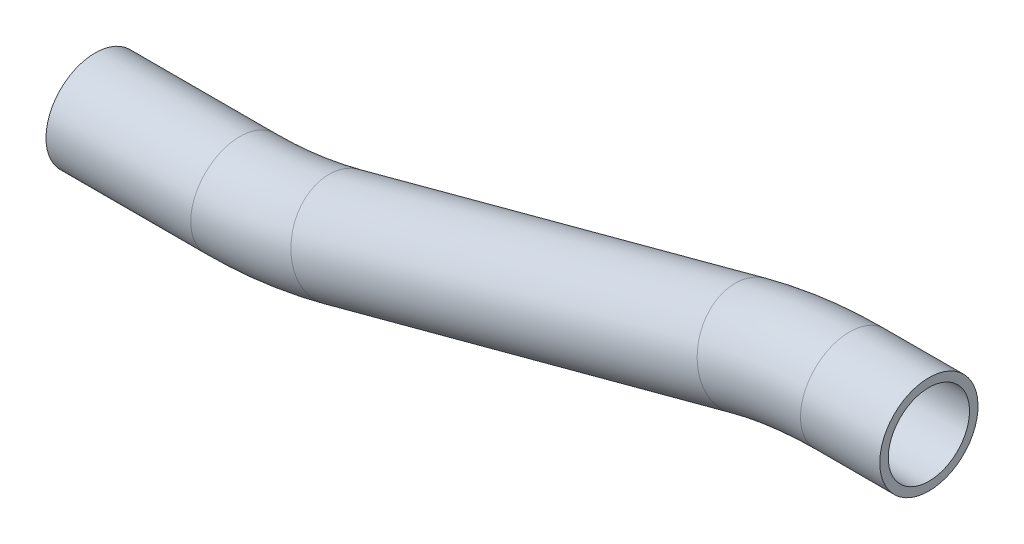
ISO-10303-21;
HEADER;
FILE_DESCRIPTION(('STEP AP214'),'2;1');
FILE_NAME('part.step','',(''),(''),'','','');
FILE_SCHEMA(('AUTOMOTIVE_DESIGN { 1 0 10303 214 1 1 1 1 }'));
ENDSEC;
DATA;
#1=APPLICATION_CONTEXT('core data for automotive mechanical design processes');
#2=APPLICATION_PROTOCOL_DEFINITION('international standard','automotive_design',2000,#1);
#3=PRODUCT_CONTEXT('',#1,'mechanical');
#4=PRODUCT('Part','Part','',(#3));
#5=PRODUCT_RELATED_PRODUCT_CATEGORY('part','',(#4));
#6=PRODUCT_DEFINITION_FORMATION('','',#4);
#7=PRODUCT_DEFINITION_CONTEXT('part definition',#1,'design');
#8=PRODUCT_DEFINITION('design','',#6,#7);
#9=PRODUCT_DEFINITION_SHAPE('','',#8);
#10=(LENGTH_UNIT() NAMED_UNIT(*) SI_UNIT(.MILLI.,.METRE.));
#11=(NAMED_UNIT(*) PLANE_ANGLE_UNIT() SI_UNIT($,.RADIAN.));
#12=(NAMED_UNIT(*) SI_UNIT($,.STERADIAN.) SOLID_ANGLE_UNIT());
#13=UNCERTAINTY_MEASURE_WITH_UNIT(LENGTH_MEASURE(1.E-05),#10,'distance_accuracy_value','');
#14=(GEOMETRIC_REPRESENTATION_CONTEXT(3) GLOBAL_UNCERTAINTY_ASSIGNED_CONTEXT((#13)) GLOBAL_UNIT_ASSIGNED_CONTEXT((#10,
#11,#12)) REPRESENTATION_CONTEXT('',''));
#15=CARTESIAN_POINT('',(0.,0.,0.));
#16=DIRECTION('',(0.,0.,1.));
#17=DIRECTION('',(1.,0.,0.));
#18=AXIS2_PLACEMENT_3D('',#15,#16,#17);
#19=CARTESIAN_POINT('',(15.3680796838403,0.,0.));
#20=DIRECTION('',(-1.,0.,0.));
#21=DIRECTION('',(0.,-1.,0.));
#22=AXIS2_PLACEMENT_3D('',#19,#20,#21);
#23=CYLINDRICAL_SURFACE('',#22,9.525);
#24=CARTESIAN_POINT('',(0.,0.,0.));
#25=DIRECTION('',(-1.,0.,0.));
#26=DIRECTION('',(0.,-1.,0.));
#27=AXIS2_PLACEMENT_3D('',#24,#25,#26);
#28=CIRCLE('',#27,9.525);
#29=CARTESIAN_POINT('',(0.,9.52499999999998,0.));
#30=VERTEX_POINT('',#29);
#31=EDGE_CURVE('E61',#30,#30,#28,.T.);
#32=ORIENTED_EDGE('',*,*,#31,.F.);
#33=EDGE_LOOP('',(#32));
#34=FACE_BOUND('',#33,.T.);
#35=CARTESIAN_POINT('',(15.3680796838403,0.,0.));
#36=DIRECTION('',(-1.,0.,0.));
#37=DIRECTION('',(0.,-1.,0.));
#38=AXIS2_PLACEMENT_3D('',#35,#36,#37);
#39=CIRCLE('',#38,9.525);
#40=CARTESIAN_POINT('',(15.3680796838403,-9.525,0.));
#41=VERTEX_POINT('',#40);
#42=EDGE_CURVE('E58',#41,#41,#39,.T.);
#43=ORIENTED_EDGE('',*,*,#42,.T.);
#44=EDGE_LOOP('',(#43));
#45=FACE_BOUND('',#44,.T.);
#46=ADVANCED_FACE('F37',(#34,#45),#23,.T.);
#47=CARTESIAN_POINT('',(0.,-76.2,0.));
#48=DIRECTION('',(0.,0.,1.));
#49=DIRECTION('',(1.,0.,0.));
#50=AXIS2_PLACEMENT_3D('',#47,#48,#49);
#51=TOROIDAL_SURFACE('',#50,76.2,9.525);
#52=CARTESIAN_POINT('',(-19.7220112368122,-2.59645203677303,0.));
#53=DIRECTION('',(-0.965925826289068,-0.258819045102522,0.));
#54=DIRECTION('',(0.258819045102522,-0.965925826289068,0.));
#55=AXIS2_PLACEMENT_3D('',#52,#53,#54);
#56=CIRCLE('',#55,9.525);
#57=CARTESIAN_POINT('',(-22.1872626414137,6.60399145863036,0.));
#58=VERTEX_POINT('',#57);
#59=EDGE_CURVE('E64',#58,#58,#56,.T.);
#60=CARTESIAN_POINT('',(0.,-76.2,0.));
#61=DIRECTION('',(0.,0.,1.));
#62=DIRECTION('',(1.,0.,0.));
#63=AXIS2_PLACEMENT_3D('',#60,#61,#62);
#64=CIRCLE('',#63,85.725);
#65=EDGE_CURVE('',#30,#58,#64,.T.);
#66=ORIENTED_EDGE('',*,*,#31,.T.);
#67=ORIENTED_EDGE('',*,*,#59,.F.);
#68=ORIENTED_EDGE('',*,*,#65,.T.);
#69=ORIENTED_EDGE('',*,*,#65,.F.);
#70=EDGE_LOOP('',(#66,#68,#67,#69));
#71=FACE_BOUND('',#70,.T.);
#72=ADVANCED_FACE('F83',(#71),#51,.T.);
#73=CARTESIAN_POINT('',(-19.7220112368122,-2.59645203677303,0.));
#74=DIRECTION('',(-0.965925826289068,-0.258819045102522,0.));
#75=DIRECTION('',(0.258819045102522,-0.965925826289068,0.));
#76=AXIS2_PLACEMENT_3D('',#73,#74,#75);
#77=CYLINDRICAL_SURFACE('',#76,9.525);
#78=CARTESIAN_POINT('',(-98.4798933464764,-23.6995629456432,0.));
#79=DIRECTION('',(-0.965925826289068,-0.258819045102522,0.));
#80=DIRECTION('',(0.258819045102522,-0.965925826289068,0.));
#81=AXIS2_PLACEMENT_3D('',#78,#79,#80);
#82=CIRCLE('',#81,9.525);
#83=CARTESIAN_POINT('',(-96.0146419418749,-32.9000064410466,0.));
#84=VERTEX_POINT('',#83);
#85=EDGE_CURVE('E66',#84,#84,#82,.T.);
#86=ORIENTED_EDGE('',*,*,#85,.F.);
#87=EDGE_LOOP('',(#86));
#88=FACE_BOUND('',#87,.T.);
#89=ORIENTED_EDGE('',*,*,#59,.T.);
#90=EDGE_LOOP('',(#89));
#91=FACE_BOUND('',#90,.T.);
#92=ADVANCED_FACE('F76',(#88,#91),#77,.T.);
#93=CARTESIAN_POINT('',(-118.201904583289,49.9039850175838,0.));
#94=DIRECTION('',(0.,0.,-1.));
#95=DIRECTION('',(-1.,0.,0.));
#96=AXIS2_PLACEMENT_3D('',#93,#94,#95);
#97=TOROIDAL_SURFACE('',#96,76.2,9.525);
#98=CARTESIAN_POINT('',(-118.201904583288,-26.2960149824163,0.));
#99=DIRECTION('',(-1.,0.,0.));
#100=DIRECTION('',(0.,-1.,0.));
#101=AXIS2_PLACEMENT_3D('',#98,#99,#100);
#102=CIRCLE('',#101,9.525);
#103=CARTESIAN_POINT('',(-118.201904583288,-35.8210149824162,0.));
#104=VERTEX_POINT('',#103);
#105=EDGE_CURVE('E41',#104,#104,#102,.T.);
#106=CARTESIAN_POINT('',(-118.201904583289,49.9039850175838,0.));
#107=DIRECTION('',(0.,0.,-1.));
#108=DIRECTION('',(-1.,0.,0.));
#109=AXIS2_PLACEMENT_3D('',#106,#107,#108);
#110=CIRCLE('',#109,85.725);
#111=EDGE_CURVE('',#84,#104,#110,.T.);
#112=ORIENTED_EDGE('',*,*,#85,.T.);
#113=ORIENTED_EDGE('',*,*,#105,.F.);
#114=ORIENTED_EDGE('',*,*,#111,.T.);
#115=ORIENTED_EDGE('',*,*,#111,.F.);
#116=EDGE_LOOP('',(#112,#114,#113,#115));
#117=FACE_BOUND('',#116,.T.);
#118=ADVANCED_FACE('F74',(#117),#97,.T.);
#119=CARTESIAN_POINT('',(-118.201904583288,-26.2960149824163,0.));
#120=DIRECTION('',(-1.,0.,0.));
#121=DIRECTION('',(0.,-1.,0.));
#122=AXIS2_PLACEMENT_3D('',#119,#120,#121);
#123=CYLINDRICAL_SURFACE('',#122,9.525);
#124=CARTESIAN_POINT('',(-146.269984267129,-26.2960149824163,0.));
#125=DIRECTION('',(-1.,0.,0.));
#126=DIRECTION('',(0.,-1.,0.));
#127=AXIS2_PLACEMENT_3D('',#124,#125,#126);
#128=CIRCLE('',#127,9.525);
#129=CARTESIAN_POINT('',(-146.269984267129,-35.8210149824163,0.));
#130=VERTEX_POINT('',#129);
#131=EDGE_CURVE('E54',#130,#130,#128,.T.);
#132=ORIENTED_EDGE('',*,*,#131,.F.);
#133=EDGE_LOOP('',(#132));
#134=FACE_BOUND('',#133,.T.);
#135=ORIENTED_EDGE('',*,*,#105,.T.);
#136=EDGE_LOOP('',(#135));
#137=FACE_BOUND('',#136,.T.);
#138=ADVANCED_FACE('F39',(#134,#137),#123,.T.);
#139=CARTESIAN_POINT('',(15.3680796838403,0.,0.));
#140=DIRECTION('',(-1.,0.,0.));
#141=DIRECTION('',(0.,-1.,0.));
#142=AXIS2_PLACEMENT_3D('',#139,#140,#141);
#143=PLANE('',#142);
#144=CARTESIAN_POINT('',(15.3680796838403,0.,0.));
#145=DIRECTION('',(-1.,0.,0.));
#146=DIRECTION('',(0.,-1.,0.));
#147=AXIS2_PLACEMENT_3D('',#144,#145,#146);
#148=CIRCLE('',#147,7.874);
#149=CARTESIAN_POINT('',(15.3680796838403,-7.874,0.));
#150=VERTEX_POINT('',#149);
#151=EDGE_CURVE('E57',#150,#150,#148,.F.);
#152=ORIENTED_EDGE('',*,*,#151,.F.);
#153=EDGE_LOOP('',(#152));
#154=FACE_BOUND('',#153,.T.);
#155=ORIENTED_EDGE('',*,*,#42,.F.);
#156=EDGE_LOOP('',(#155));
#157=FACE_BOUND('',#156,.T.);
#158=ADVANCED_FACE('F81',(#154,#157),#143,.F.);
#159=CARTESIAN_POINT('',(-146.269984267129,-26.2960149824163,0.));
#160=DIRECTION('',(-1.,0.,0.));
#161=DIRECTION('',(0.,-1.,0.));
#162=AXIS2_PLACEMENT_3D('',#159,#160,#161);
#163=PLANE('',#162);
#164=CARTESIAN_POINT('',(-146.269984267129,-26.2960149824163,0.));
#165=DIRECTION('',(-1.,0.,0.));
#166=DIRECTION('',(0.,-1.,0.));
#167=AXIS2_PLACEMENT_3D('',#164,#165,#166);
#168=CIRCLE('',#167,7.874);
#169=CARTESIAN_POINT('',(-146.269984267129,-34.1700149824163,0.));
#170=VERTEX_POINT('',#169);
#171=EDGE_CURVE('E10',#170,#170,#168,.F.);
#172=ORIENTED_EDGE('',*,*,#171,.T.);
#173=EDGE_LOOP('',(#172));
#174=FACE_BOUND('',#173,.T.);
#175=ORIENTED_EDGE('',*,*,#131,.T.);
#176=EDGE_LOOP('',(#175));
#177=FACE_BOUND('',#176,.T.);
#178=ADVANCED_FACE('F100',(#174,#177),#163,.T.);
#179=CARTESIAN_POINT('',(15.3680796838403,0.,0.));
#180=DIRECTION('',(-1.,0.,0.));
#181=DIRECTION('',(0.,-1.,0.));
#182=AXIS2_PLACEMENT_3D('',#179,#180,#181);
#183=CYLINDRICAL_SURFACE('',#182,7.874);
#184=CARTESIAN_POINT('',(0.,0.,0.));
#185=DIRECTION('',(-1.,0.,0.));
#186=DIRECTION('',(0.,-1.,0.));
#187=AXIS2_PLACEMENT_3D('',#184,#185,#186);
#188=CIRCLE('',#187,7.874);
#189=CARTESIAN_POINT('',(0.,7.87399999999996,0.));
#190=VERTEX_POINT('',#189);
#191=EDGE_CURVE('E198',#190,#190,#188,.F.);
#192=ORIENTED_EDGE('',*,*,#191,.F.);
#193=EDGE_LOOP('',(#192));
#194=FACE_BOUND('',#193,.T.);
#195=ORIENTED_EDGE('',*,*,#151,.T.);
#196=EDGE_LOOP('',(#195));
#197=FACE_BOUND('',#196,.T.);
#198=ADVANCED_FACE('F103',(#194,#197),#183,.F.);
#199=CARTESIAN_POINT('',(0.,-76.2,0.));
#200=DIRECTION('',(0.,0.,1.));
#201=DIRECTION('',(1.,0.,0.));
#202=AXIS2_PLACEMENT_3D('',#199,#200,#201);
#203=TOROIDAL_SURFACE('',#202,76.2,7.874);
#204=CARTESIAN_POINT('',(-19.7220112368122,-2.59645203677303,0.));
#205=DIRECTION('',(-0.965925826289068,-0.258819045102522,0.));
#206=DIRECTION('',(0.258819045102522,-0.965925826289068,0.));
#207=AXIS2_PLACEMENT_3D('',#204,#205,#206);
#208=CIRCLE('',#207,7.874);
#209=CARTESIAN_POINT('',(-21.7599523979494,5.00924791942708,0.));
#210=VERTEX_POINT('',#209);
#211=EDGE_CURVE('E197',#210,#210,#208,.F.);
#212=CARTESIAN_POINT('',(0.,-76.2,0.));
#213=DIRECTION('',(0.,0.,1.));
#214=DIRECTION('',(1.,0.,0.));
#215=AXIS2_PLACEMENT_3D('',#212,#213,#214);
#216=CIRCLE('',#215,84.074);
#217=EDGE_CURVE('',#190,#210,#216,.T.);
#218=ORIENTED_EDGE('',*,*,#191,.T.);
#219=ORIENTED_EDGE('',*,*,#211,.F.);
#220=ORIENTED_EDGE('',*,*,#217,.T.);
#221=ORIENTED_EDGE('',*,*,#217,.F.);
#222=EDGE_LOOP('',(#218,#220,#219,#221));
#223=FACE_BOUND('',#222,.T.);
#224=ADVANCED_FACE('F160',(#223),#203,.F.);
#225=CARTESIAN_POINT('',(-19.7220112368122,-2.59645203677303,0.));
#226=DIRECTION('',(-0.965925826289068,-0.258819045102522,0.));
#227=DIRECTION('',(0.258819045102522,-0.965925826289068,0.));
#228=AXIS2_PLACEMENT_3D('',#225,#226,#227);
#229=CYLINDRICAL_SURFACE('',#228,7.874);
#230=CARTESIAN_POINT('',(-98.4798933464764,-23.6995629456432,0.));
#231=DIRECTION('',(-0.965925826289068,-0.258819045102522,0.));
#232=DIRECTION('',(0.258819045102522,-0.965925826289068,0.));
#233=AXIS2_PLACEMENT_3D('',#230,#231,#232);
#234=CIRCLE('',#233,7.874);
#235=CARTESIAN_POINT('',(-96.4419521853391,-31.3052629018433,0.));
#236=VERTEX_POINT('',#235);
#237=EDGE_CURVE('E50',#236,#236,#234,.F.);
#238=ORIENTED_EDGE('',*,*,#237,.F.);
#239=EDGE_LOOP('',(#238));
#240=FACE_BOUND('',#239,.T.);
#241=ORIENTED_EDGE('',*,*,#211,.T.);
#242=EDGE_LOOP('',(#241));
#243=FACE_BOUND('',#242,.T.);
#244=ADVANCED_FACE('F94',(#240,#243),#229,.F.);
#245=CARTESIAN_POINT('',(-118.201904583289,49.9039850175838,0.));
#246=DIRECTION('',(0.,0.,-1.));
#247=DIRECTION('',(-1.,0.,0.));
#248=AXIS2_PLACEMENT_3D('',#245,#246,#247);
#249=TOROIDAL_SURFACE('',#248,76.2,7.874);
#250=CARTESIAN_POINT('',(-118.201904583288,-26.2960149824163,0.));
#251=DIRECTION('',(-1.,0.,0.));
#252=DIRECTION('',(0.,-1.,0.));
#253=AXIS2_PLACEMENT_3D('',#250,#251,#252);
#254=CIRCLE('',#253,7.874);
#255=CARTESIAN_POINT('',(-118.201904583288,-34.1700149824162,0.));
#256=VERTEX_POINT('',#255);
#257=EDGE_CURVE('E45',#256,#256,#254,.F.);
#258=CARTESIAN_POINT('',(-118.201904583289,49.9039850175838,0.));
#259=DIRECTION('',(0.,0.,-1.));
#260=DIRECTION('',(-1.,0.,0.));
#261=AXIS2_PLACEMENT_3D('',#258,#259,#260);
#262=CIRCLE('',#261,84.074);
#263=EDGE_CURVE('',#236,#256,#262,.T.);
#264=ORIENTED_EDGE('',*,*,#237,.T.);
#265=ORIENTED_EDGE('',*,*,#257,.F.);
#266=ORIENTED_EDGE('',*,*,#263,.T.);
#267=ORIENTED_EDGE('',*,*,#263,.F.);
#268=EDGE_LOOP('',(#264,#266,#265,#267));
#269=FACE_BOUND('',#268,.T.);
#270=ADVANCED_FACE('F88',(#269),#249,.F.);
#271=CARTESIAN_POINT('',(-118.201904583288,-26.2960149824163,0.));
#272=DIRECTION('',(-1.,0.,0.));
#273=DIRECTION('',(0.,-1.,0.));
#274=AXIS2_PLACEMENT_3D('',#271,#272,#273);
#275=CYLINDRICAL_SURFACE('',#274,7.874);
#276=ORIENTED_EDGE('',*,*,#171,.F.);
#277=EDGE_LOOP('',(#276));
#278=FACE_BOUND('',#277,.T.);
#279=ORIENTED_EDGE('',*,*,#257,.T.);
#280=EDGE_LOOP('',(#279));
#281=FACE_BOUND('',#280,.T.);
#282=ADVANCED_FACE('F86',(#278,#281),#275,.F.);
#283=CLOSED_SHELL('',(#46,#72,#92,#118,#138,#158,#178,#198,#224,#244,#270,#282));
#284=MANIFOLD_SOLID_BREP('B2',#283);
#285=ADVANCED_BREP_SHAPE_REPRESENTATION('',(#18,#284),#14);
#286=SHAPE_DEFINITION_REPRESENTATION(#9,#285);
ENDSEC;
END-ISO-10303-21;
